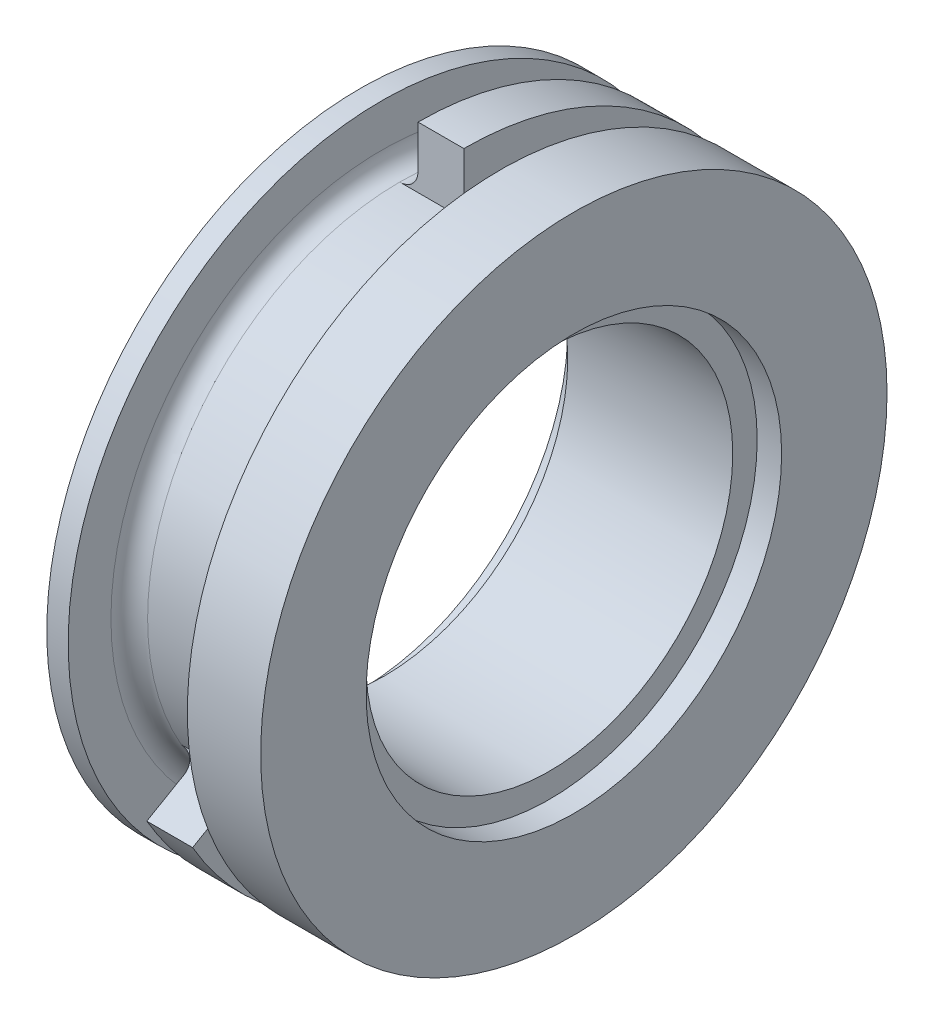
ISO-10303-21;
HEADER;
FILE_DESCRIPTION(('STEP AP214'),'2;1');
FILE_NAME('part.step','',(''),(''),'','','');
FILE_SCHEMA(('AUTOMOTIVE_DESIGN { 1 0 10303 214 1 1 1 1 }'));
ENDSEC;
DATA;
#1=APPLICATION_CONTEXT('core data for automotive mechanical design processes');
#2=APPLICATION_PROTOCOL_DEFINITION('international standard','automotive_design',2000,#1);
#3=PRODUCT_CONTEXT('',#1,'mechanical');
#4=PRODUCT('Part','Part','',(#3));
#5=PRODUCT_RELATED_PRODUCT_CATEGORY('part','',(#4));
#6=PRODUCT_DEFINITION_FORMATION('','',#4);
#7=PRODUCT_DEFINITION_CONTEXT('part definition',#1,'design');
#8=PRODUCT_DEFINITION('design','',#6,#7);
#9=PRODUCT_DEFINITION_SHAPE('','',#8);
#10=(LENGTH_UNIT() NAMED_UNIT(*) SI_UNIT(.MILLI.,.METRE.));
#11=(NAMED_UNIT(*) PLANE_ANGLE_UNIT() SI_UNIT($,.RADIAN.));
#12=(NAMED_UNIT(*) SI_UNIT($,.STERADIAN.) SOLID_ANGLE_UNIT());
#13=UNCERTAINTY_MEASURE_WITH_UNIT(LENGTH_MEASURE(1.E-05),#10,'distance_accuracy_value','');
#14=(GEOMETRIC_REPRESENTATION_CONTEXT(3) GLOBAL_UNCERTAINTY_ASSIGNED_CONTEXT((#13)) GLOBAL_UNIT_ASSIGNED_CONTEXT((#10,
#11,#12)) REPRESENTATION_CONTEXT('',''));
#15=CARTESIAN_POINT('',(0.,0.,0.));
#16=DIRECTION('',(0.,0.,1.));
#17=DIRECTION('',(1.,0.,0.));
#18=AXIS2_PLACEMENT_3D('',#15,#16,#17);
#19=CARTESIAN_POINT('',(7.,0.,0.));
#20=DIRECTION('',(1.,0.,0.));
#21=DIRECTION('',(0.,0.,-1.));
#22=AXIS2_PLACEMENT_3D('',#19,#20,#21);
#23=CYLINDRICAL_SURFACE('',#22,6.);
#24=CARTESIAN_POINT('',(6.2,0.,0.));
#25=DIRECTION('',(1.,0.,0.));
#26=DIRECTION('',(0.,0.,-1.));
#27=AXIS2_PLACEMENT_3D('',#24,#25,#26);
#28=CIRCLE('',#27,6.);
#29=CARTESIAN_POINT('',(6.2,0.,-6.));
#30=VERTEX_POINT('',#29);
#31=EDGE_CURVE('E180',#30,#30,#28,.T.);
#32=ORIENTED_EDGE('',*,*,#31,.T.);
#33=EDGE_LOOP('',(#32));
#34=FACE_BOUND('',#33,.T.);
#35=CARTESIAN_POINT('',(0.8,0.,0.));
#36=DIRECTION('',(-1.,0.,0.));
#37=DIRECTION('',(0.,0.,1.));
#38=AXIS2_PLACEMENT_3D('',#35,#36,#37);
#39=CIRCLE('',#38,6.);
#40=CARTESIAN_POINT('',(0.8,0.,6.));
#41=VERTEX_POINT('',#40);
#42=EDGE_CURVE('E51',#41,#41,#39,.T.);
#43=ORIENTED_EDGE('',*,*,#42,.T.);
#44=EDGE_LOOP('',(#43));
#45=FACE_BOUND('',#44,.T.);
#46=ADVANCED_FACE('F47',(#34,#45),#23,.F.);
#47=CARTESIAN_POINT('',(7.,0.,0.));
#48=DIRECTION('',(-1.,0.,0.));
#49=DIRECTION('',(0.,0.,1.));
#50=AXIS2_PLACEMENT_3D('',#47,#48,#49);
#51=PLANE('',#50);
#52=CARTESIAN_POINT('',(7.,0.,0.));
#53=DIRECTION('',(1.,0.,0.));
#54=DIRECTION('',(0.,0.,-1.));
#55=AXIS2_PLACEMENT_3D('',#52,#53,#54);
#56=CIRCLE('',#55,6.8);
#57=CARTESIAN_POINT('',(7.,0.,-6.8));
#58=VERTEX_POINT('',#57);
#59=EDGE_CURVE('E188',#58,#58,#56,.T.);
#60=ORIENTED_EDGE('',*,*,#59,.F.);
#61=EDGE_LOOP('',(#60));
#62=FACE_BOUND('',#61,.T.);
#63=CARTESIAN_POINT('',(7.,0.,0.));
#64=DIRECTION('',(1.,0.,0.));
#65=DIRECTION('',(0.,0.,-1.));
#66=AXIS2_PLACEMENT_3D('',#63,#64,#65);
#67=CIRCLE('',#66,10.25);
#68=CARTESIAN_POINT('',(7.,0.,-10.25));
#69=VERTEX_POINT('',#68);
#70=EDGE_CURVE('E136',#69,#69,#67,.T.);
#71=ORIENTED_EDGE('',*,*,#70,.T.);
#72=EDGE_LOOP('',(#71));
#73=FACE_BOUND('',#72,.T.);
#74=ADVANCED_FACE('F243',(#62,#73),#51,.F.);
#75=CARTESIAN_POINT('',(7.,0.,0.));
#76=DIRECTION('',(1.,0.,0.));
#77=DIRECTION('',(0.,0.,-1.));
#78=AXIS2_PLACEMENT_3D('',#75,#76,#77);
#79=CYLINDRICAL_SURFACE('',#78,10.25);
#80=ORIENTED_EDGE('',*,*,#70,.F.);
#81=EDGE_LOOP('',(#80));
#82=FACE_BOUND('',#81,.T.);
#83=CARTESIAN_POINT('',(4.6,0.,0.));
#84=DIRECTION('',(1.,0.,0.));
#85=DIRECTION('',(0.,0.,-1.));
#86=AXIS2_PLACEMENT_3D('',#83,#84,#85);
#87=CIRCLE('',#86,10.25);
#88=CARTESIAN_POINT('',(4.6,0.,-10.25));
#89=VERTEX_POINT('',#88);
#90=EDGE_CURVE('E131',#89,#89,#87,.T.);
#91=ORIENTED_EDGE('',*,*,#90,.T.);
#92=EDGE_LOOP('',(#91));
#93=FACE_BOUND('',#92,.T.);
#94=ADVANCED_FACE('F248',(#82,#93),#79,.T.);
#95=CARTESIAN_POINT('',(4.6,0.,0.));
#96=DIRECTION('',(1.,0.,0.));
#97=DIRECTION('',(0.,0.,-1.));
#98=AXIS2_PLACEMENT_3D('',#95,#96,#97);
#99=PLANE('',#98);
#100=CARTESIAN_POINT('',(4.6,0.,0.));
#101=DIRECTION('',(1.,0.,0.));
#102=DIRECTION('',(0.,0.,-1.));
#103=AXIS2_PLACEMENT_3D('',#100,#101,#102);
#104=CIRCLE('',#103,8.85);
#105=CARTESIAN_POINT('',(4.6,0.,-8.85));
#106=VERTEX_POINT('',#105);
#107=EDGE_CURVE('E145',#106,#106,#104,.T.);
#108=ORIENTED_EDGE('',*,*,#107,.T.);
#109=EDGE_LOOP('',(#108));
#110=FACE_BOUND('',#109,.T.);
#111=ORIENTED_EDGE('',*,*,#90,.F.);
#112=EDGE_LOOP('',(#111));
#113=FACE_BOUND('',#112,.T.);
#114=ADVANCED_FACE('F405',(#110,#113),#99,.F.);
#115=CARTESIAN_POINT('',(3.4,0.,0.));
#116=DIRECTION('',(-1.,0.,0.));
#117=DIRECTION('',(0.,0.,1.));
#118=AXIS2_PLACEMENT_3D('',#115,#116,#117);
#119=PLANE('',#118);
#120=DIRECTION('',(0.,1.,0.));
#121=VECTOR('',#120,1.);
#122=CARTESIAN_POINT('',(3.4,10.25,0.));
#123=LINE('',#122,#121);
#124=CARTESIAN_POINT('',(3.4,8.85,0.));
#125=VERTEX_POINT('',#124);
#126=CARTESIAN_POINT('',(3.4,10.25,0.));
#127=VERTEX_POINT('',#126);
#128=EDGE_CURVE('E101',#125,#127,#123,.T.);
#129=ORIENTED_EDGE('',*,*,#128,.F.);
#130=CARTESIAN_POINT('',(3.4,0.,0.));
#131=DIRECTION('',(-1.,0.,0.));
#132=DIRECTION('',(0.,0.,1.));
#133=AXIS2_PLACEMENT_3D('',#130,#131,#132);
#134=CIRCLE('',#133,8.85);
#135=CARTESIAN_POINT('',(3.4,-4.42500000000004,7.66432482349226));
#136=VERTEX_POINT('',#135);
#137=EDGE_CURVE('E157',#125,#136,#134,.T.);
#138=ORIENTED_EDGE('',*,*,#137,.T.);
#139=DIRECTION('',(0.,-0.500000000000004,0.866025403784436));
#140=VECTOR('',#139,1.);
#141=CARTESIAN_POINT('',(3.4,-5.12500000000004,8.87676038879047));
#142=LINE('',#141,#140);
#143=CARTESIAN_POINT('',(3.4,-5.12500000000004,8.87676038879047));
#144=VERTEX_POINT('',#143);
#145=EDGE_CURVE('E128',#136,#144,#142,.T.);
#146=ORIENTED_EDGE('',*,*,#145,.T.);
#147=CARTESIAN_POINT('',(3.4,0.,0.));
#148=DIRECTION('',(1.,0.,0.));
#149=DIRECTION('',(0.,0.,-1.));
#150=AXIS2_PLACEMENT_3D('',#147,#148,#149);
#151=CIRCLE('',#150,10.25);
#152=EDGE_CURVE('E120',#144,#127,#151,.T.);
#153=ORIENTED_EDGE('',*,*,#152,.T.);
#154=EDGE_LOOP('',(#129,#138,#146,#153));
#155=FACE_BOUND('',#154,.T.);
#156=ADVANCED_FACE('F126',(#155),#119,.F.);
#157=CARTESIAN_POINT('',(7.,0.,0.));
#158=DIRECTION('',(1.,0.,0.));
#159=DIRECTION('',(0.,0.,-1.));
#160=AXIS2_PLACEMENT_3D('',#157,#158,#159);
#161=CYLINDRICAL_SURFACE('',#160,10.25);
#162=ORIENTED_EDGE('',*,*,#152,.F.);
#163=DIRECTION('',(-1.,0.,0.));
#164=VECTOR('',#163,1.);
#165=CARTESIAN_POINT('',(1.9,-5.12500000000004,8.87676038879047));
#166=LINE('',#165,#164);
#167=CARTESIAN_POINT('',(1.9,-5.12500000000004,8.87676038879047));
#168=VERTEX_POINT('',#167);
#169=EDGE_CURVE('E206',#144,#168,#166,.T.);
#170=ORIENTED_EDGE('',*,*,#169,.T.);
#171=CARTESIAN_POINT('',(1.9,0.,0.));
#172=DIRECTION('',(1.,0.,0.));
#173=DIRECTION('',(0.,0.,-1.));
#174=AXIS2_PLACEMENT_3D('',#171,#172,#173);
#175=CIRCLE('',#174,10.25);
#176=CARTESIAN_POINT('',(1.9,10.25,0.));
#177=VERTEX_POINT('',#176);
#178=EDGE_CURVE('E122',#168,#177,#175,.T.);
#179=ORIENTED_EDGE('',*,*,#178,.T.);
#180=DIRECTION('',(-1.,0.,0.));
#181=VECTOR('',#180,1.);
#182=CARTESIAN_POINT('',(1.9,10.25,0.));
#183=LINE('',#182,#181);
#184=EDGE_CURVE('E105',#127,#177,#183,.T.);
#185=ORIENTED_EDGE('',*,*,#184,.F.);
#186=EDGE_LOOP('',(#162,#170,#179,#185));
#187=FACE_BOUND('',#186,.T.);
#188=ADVANCED_FACE('F118',(#187),#161,.T.);
#189=CARTESIAN_POINT('',(1.9,0.,0.));
#190=DIRECTION('',(1.,0.,0.));
#191=DIRECTION('',(0.,0.,-1.));
#192=AXIS2_PLACEMENT_3D('',#189,#190,#191);
#193=PLANE('',#192);
#194=DIRECTION('',(0.,0.500000000000004,-0.866025403784436));
#195=VECTOR('',#194,1.);
#196=CARTESIAN_POINT('',(1.9,-5.12500000000004,8.87676038879047));
#197=LINE('',#196,#195);
#198=CARTESIAN_POINT('',(1.9,-4.42500000000003,7.66432482349226));
#199=VERTEX_POINT('',#198);
#200=EDGE_CURVE('E209',#168,#199,#197,.T.);
#201=ORIENTED_EDGE('',*,*,#200,.T.);
#202=CARTESIAN_POINT('',(1.9,0.,0.));
#203=DIRECTION('',(1.,0.,0.));
#204=DIRECTION('',(0.,0.,-1.));
#205=AXIS2_PLACEMENT_3D('',#202,#203,#204);
#206=CIRCLE('',#205,8.85);
#207=CARTESIAN_POINT('',(1.9,8.85,0.));
#208=VERTEX_POINT('',#207);
#209=EDGE_CURVE('E160',#199,#208,#206,.T.);
#210=ORIENTED_EDGE('',*,*,#209,.T.);
#211=DIRECTION('',(0.,-1.,0.));
#212=VECTOR('',#211,1.);
#213=CARTESIAN_POINT('',(1.9,10.25,0.));
#214=LINE('',#213,#212);
#215=EDGE_CURVE('E124',#177,#208,#214,.T.);
#216=ORIENTED_EDGE('',*,*,#215,.F.);
#217=ORIENTED_EDGE('',*,*,#178,.F.);
#218=EDGE_LOOP('',(#201,#210,#216,#217));
#219=FACE_BOUND('',#218,.T.);
#220=ADVANCED_FACE('F362',(#219),#193,.F.);
#221=CARTESIAN_POINT('',(7.,0.,0.));
#222=DIRECTION('',(1.,0.,0.));
#223=DIRECTION('',(0.,0.,-1.));
#224=AXIS2_PLACEMENT_3D('',#221,#222,#223);
#225=CYLINDRICAL_SURFACE('',#224,8.25);
#226=CARTESIAN_POINT('',(4.,0.,0.));
#227=DIRECTION('',(1.,0.,0.));
#228=DIRECTION('',(0.,0.,-1.));
#229=AXIS2_PLACEMENT_3D('',#226,#227,#228);
#230=CIRCLE('',#229,8.25);
#231=CARTESIAN_POINT('',(4.,-4.12500000000003,7.1447095812216));
#232=VERTEX_POINT('',#231);
#233=CARTESIAN_POINT('',(4.,8.25,0.));
#234=VERTEX_POINT('',#233);
#235=EDGE_CURVE('E153',#232,#234,#230,.F.);
#236=ORIENTED_EDGE('',*,*,#235,.T.);
#237=DIRECTION('',(1.,0.,0.));
#238=VECTOR('',#237,1.);
#239=CARTESIAN_POINT('',(1.9,8.25,0.));
#240=LINE('',#239,#238);
#241=CARTESIAN_POINT('',(1.3,8.25,0.));
#242=VERTEX_POINT('',#241);
#243=EDGE_CURVE('E201',#242,#234,#240,.T.);
#244=ORIENTED_EDGE('',*,*,#243,.F.);
#245=CARTESIAN_POINT('',(1.3,0.,0.));
#246=DIRECTION('',(-1.,0.,0.));
#247=DIRECTION('',(0.,0.,1.));
#248=AXIS2_PLACEMENT_3D('',#245,#246,#247);
#249=CIRCLE('',#248,8.25);
#250=CARTESIAN_POINT('',(1.3,-4.12500000000003,7.1447095812216));
#251=VERTEX_POINT('',#250);
#252=EDGE_CURVE('E149',#242,#251,#249,.F.);
#253=ORIENTED_EDGE('',*,*,#252,.T.);
#254=DIRECTION('',(1.,0.,0.));
#255=VECTOR('',#254,1.);
#256=CARTESIAN_POINT('',(1.9,-4.12500000000003,7.1447095812216));
#257=LINE('',#256,#255);
#258=EDGE_CURVE('E212',#251,#232,#257,.T.);
#259=ORIENTED_EDGE('',*,*,#258,.T.);
#260=EDGE_LOOP('',(#236,#244,#253,#259));
#261=FACE_BOUND('',#260,.T.);
#262=ADVANCED_FACE('F357',(#261),#225,.T.);
#263=CARTESIAN_POINT('',(0.7,0.,0.));
#264=DIRECTION('',(-1.,0.,0.));
#265=DIRECTION('',(0.,0.,1.));
#266=AXIS2_PLACEMENT_3D('',#263,#264,#265);
#267=PLANE('',#266);
#268=CARTESIAN_POINT('',(0.7,0.,0.));
#269=DIRECTION('',(-1.,0.,0.));
#270=DIRECTION('',(0.,0.,1.));
#271=AXIS2_PLACEMENT_3D('',#268,#269,#270);
#272=CIRCLE('',#271,8.85);
#273=CARTESIAN_POINT('',(0.7,0.,8.85));
#274=VERTEX_POINT('',#273);
#275=EDGE_CURVE('E163',#274,#274,#272,.T.);
#276=ORIENTED_EDGE('',*,*,#275,.T.);
#277=EDGE_LOOP('',(#276));
#278=FACE_BOUND('',#277,.T.);
#279=CARTESIAN_POINT('',(0.7,0.,0.));
#280=DIRECTION('',(1.,0.,0.));
#281=DIRECTION('',(0.,0.,-1.));
#282=AXIS2_PLACEMENT_3D('',#279,#280,#281);
#283=CIRCLE('',#282,10.25);
#284=CARTESIAN_POINT('',(0.7,0.,-10.25));
#285=VERTEX_POINT('',#284);
#286=EDGE_CURVE('E138',#285,#285,#283,.T.);
#287=ORIENTED_EDGE('',*,*,#286,.T.);
#288=EDGE_LOOP('',(#287));
#289=FACE_BOUND('',#288,.T.);
#290=ADVANCED_FACE('F222',(#278,#289),#267,.F.);
#291=CARTESIAN_POINT('',(7.,0.,0.));
#292=DIRECTION('',(1.,0.,0.));
#293=DIRECTION('',(0.,0.,-1.));
#294=AXIS2_PLACEMENT_3D('',#291,#292,#293);
#295=CYLINDRICAL_SURFACE('',#294,10.25);
#296=ORIENTED_EDGE('',*,*,#286,.F.);
#297=EDGE_LOOP('',(#296));
#298=FACE_BOUND('',#297,.T.);
#299=CARTESIAN_POINT('',(0.,0.,0.));
#300=DIRECTION('',(1.,0.,0.));
#301=DIRECTION('',(0.,0.,-1.));
#302=AXIS2_PLACEMENT_3D('',#299,#300,#301);
#303=CIRCLE('',#302,10.25);
#304=CARTESIAN_POINT('',(0.,0.,-10.25));
#305=VERTEX_POINT('',#304);
#306=EDGE_CURVE('E215',#305,#305,#303,.T.);
#307=ORIENTED_EDGE('',*,*,#306,.T.);
#308=EDGE_LOOP('',(#307));
#309=FACE_BOUND('',#308,.T.);
#310=ADVANCED_FACE('F224',(#298,#309),#295,.T.);
#311=CARTESIAN_POINT('',(0.,0.,0.));
#312=DIRECTION('',(1.,0.,0.));
#313=DIRECTION('',(0.,0.,-1.));
#314=AXIS2_PLACEMENT_3D('',#311,#312,#313);
#315=PLANE('',#314);
#316=CARTESIAN_POINT('',(0.,0.,0.));
#317=DIRECTION('',(-1.,0.,0.));
#318=DIRECTION('',(0.,0.,1.));
#319=AXIS2_PLACEMENT_3D('',#316,#317,#318);
#320=CIRCLE('',#319,6.8);
#321=CARTESIAN_POINT('',(0.,0.,6.8));
#322=VERTEX_POINT('',#321);
#323=EDGE_CURVE('E196',#322,#322,#320,.T.);
#324=ORIENTED_EDGE('',*,*,#323,.F.);
#325=EDGE_LOOP('',(#324));
#326=FACE_BOUND('',#325,.T.);
#327=ORIENTED_EDGE('',*,*,#306,.F.);
#328=EDGE_LOOP('',(#327));
#329=FACE_BOUND('',#328,.T.);
#330=ADVANCED_FACE('F227',(#326,#329),#315,.F.);
#331=CARTESIAN_POINT('',(0.,0.,0.));
#332=DIRECTION('',(0.,-0.866025403784436,-0.500000000000004));
#333=DIRECTION('',(1.,0.,0.));
#334=AXIS2_PLACEMENT_3D('',#331,#332,#333);
#335=PLANE('',#334);
#336=ORIENTED_EDGE('',*,*,#145,.F.);
#337=CARTESIAN_POINT('',(4.,-4.42500000000004,7.66432482349226));
#338=DIRECTION('',(0.,-0.866025403784436,-0.500000000000004));
#339=DIRECTION('',(0.,0.500000000000004,-0.866025403784436));
#340=AXIS2_PLACEMENT_3D('',#337,#338,#339);
#341=CIRCLE('',#340,0.6);
#342=EDGE_CURVE('E169',#136,#232,#341,.T.);
#343=ORIENTED_EDGE('',*,*,#342,.T.);
#344=ORIENTED_EDGE('',*,*,#258,.F.);
#345=CARTESIAN_POINT('',(1.3,-4.42500000000004,7.66432482349226));
#346=DIRECTION('',(0.,-0.866025403784436,-0.500000000000004));
#347=DIRECTION('',(0.,0.500000000000004,-0.866025403784436));
#348=AXIS2_PLACEMENT_3D('',#345,#346,#347);
#349=CIRCLE('',#348,0.6);
#350=EDGE_CURVE('E11',#251,#199,#349,.T.);
#351=ORIENTED_EDGE('',*,*,#350,.T.);
#352=ORIENTED_EDGE('',*,*,#200,.F.);
#353=ORIENTED_EDGE('',*,*,#169,.F.);
#354=EDGE_LOOP('',(#336,#343,#344,#351,#352,#353));
#355=FACE_BOUND('',#354,.T.);
#356=ADVANCED_FACE('F232',(#355),#335,.F.);
#357=CARTESIAN_POINT('',(0.,0.,0.));
#358=DIRECTION('',(0.,0.,1.));
#359=DIRECTION('',(1.,0.,0.));
#360=AXIS2_PLACEMENT_3D('',#357,#358,#359);
#361=PLANE('',#360);
#362=ORIENTED_EDGE('',*,*,#243,.T.);
#363=CARTESIAN_POINT('',(4.,8.85,0.));
#364=DIRECTION('',(0.,0.,1.));
#365=DIRECTION('',(1.,0.,0.));
#366=AXIS2_PLACEMENT_3D('',#363,#364,#365);
#367=CIRCLE('',#366,0.6);
#368=EDGE_CURVE('E108',#234,#125,#367,.F.);
#369=ORIENTED_EDGE('',*,*,#368,.T.);
#370=ORIENTED_EDGE('',*,*,#128,.T.);
#371=ORIENTED_EDGE('',*,*,#184,.T.);
#372=ORIENTED_EDGE('',*,*,#215,.T.);
#373=CARTESIAN_POINT('',(1.3,8.85,0.));
#374=DIRECTION('',(0.,0.,1.));
#375=DIRECTION('',(1.,0.,0.));
#376=AXIS2_PLACEMENT_3D('',#373,#374,#375);
#377=CIRCLE('',#376,0.6);
#378=EDGE_CURVE('E57',#208,#242,#377,.F.);
#379=ORIENTED_EDGE('',*,*,#378,.T.);
#380=EDGE_LOOP('',(#362,#369,#370,#371,#372,#379));
#381=FACE_BOUND('',#380,.T.);
#382=ADVANCED_FACE('F103',(#381),#361,.T.);
#383=CARTESIAN_POINT('',(4.,0.,0.));
#384=DIRECTION('',(-1.,0.,0.));
#385=DIRECTION('',(0.,0.,1.));
#386=AXIS2_PLACEMENT_3D('',#383,#384,#385);
#387=TOROIDAL_SURFACE('',#386,8.85,0.6);
#388=CARTESIAN_POINT('',(4.,0.,0.));
#389=DIRECTION('',(-1.,0.,0.));
#390=DIRECTION('',(0.,0.,1.));
#391=AXIS2_PLACEMENT_3D('',#388,#389,#390);
#392=CIRCLE('',#391,8.25);
#393=EDGE_CURVE('E113',#232,#234,#392,.F.);
#394=ORIENTED_EDGE('',*,*,#393,.F.);
#395=ORIENTED_EDGE('',*,*,#342,.F.);
#396=ORIENTED_EDGE('',*,*,#137,.F.);
#397=ORIENTED_EDGE('',*,*,#368,.F.);
#398=EDGE_LOOP('',(#394,#395,#396,#397));
#399=FACE_BOUND('',#398,.T.);
#400=ADVANCED_FACE('F255',(#399),#387,.F.);
#401=CARTESIAN_POINT('',(4.,0.,0.));
#402=DIRECTION('',(1.,0.,0.));
#403=DIRECTION('',(0.,0.,-1.));
#404=AXIS2_PLACEMENT_3D('',#401,#402,#403);
#405=TOROIDAL_SURFACE('',#404,8.85,0.6);
#406=ORIENTED_EDGE('',*,*,#235,.F.);
#407=ORIENTED_EDGE('',*,*,#393,.T.);
#408=EDGE_LOOP('',(#406,#407));
#409=FACE_BOUND('',#408,.T.);
#410=ORIENTED_EDGE('',*,*,#107,.F.);
#411=EDGE_LOOP('',(#410));
#412=FACE_BOUND('',#411,.T.);
#413=ADVANCED_FACE('F321',(#409,#412),#405,.F.);
#414=CARTESIAN_POINT('',(1.3,0.,0.));
#415=DIRECTION('',(-1.,0.,0.));
#416=DIRECTION('',(0.,0.,1.));
#417=AXIS2_PLACEMENT_3D('',#414,#415,#416);
#418=TOROIDAL_SURFACE('',#417,8.85,0.6);
#419=ORIENTED_EDGE('',*,*,#275,.F.);
#420=EDGE_LOOP('',(#419));
#421=FACE_BOUND('',#420,.T.);
#422=CARTESIAN_POINT('',(1.3,0.,0.));
#423=DIRECTION('',(-1.,0.,0.));
#424=DIRECTION('',(0.,0.,1.));
#425=AXIS2_PLACEMENT_3D('',#422,#423,#424);
#426=CIRCLE('',#425,8.25);
#427=EDGE_CURVE('E178',#251,#242,#426,.F.);
#428=ORIENTED_EDGE('',*,*,#427,.F.);
#429=ORIENTED_EDGE('',*,*,#252,.F.);
#430=EDGE_LOOP('',(#428,#429));
#431=FACE_BOUND('',#430,.T.);
#432=ADVANCED_FACE('F49',(#421,#431),#418,.F.);
#433=CARTESIAN_POINT('',(1.3,0.,0.));
#434=DIRECTION('',(1.,0.,0.));
#435=DIRECTION('',(0.,0.,-1.));
#436=AXIS2_PLACEMENT_3D('',#433,#434,#435);
#437=TOROIDAL_SURFACE('',#436,8.85,0.6);
#438=ORIENTED_EDGE('',*,*,#350,.F.);
#439=ORIENTED_EDGE('',*,*,#427,.T.);
#440=ORIENTED_EDGE('',*,*,#378,.F.);
#441=ORIENTED_EDGE('',*,*,#209,.F.);
#442=EDGE_LOOP('',(#438,#439,#440,#441));
#443=FACE_BOUND('',#442,.T.);
#444=ADVANCED_FACE('F260',(#443),#437,.F.);
#445=CARTESIAN_POINT('',(6.2,0.,0.));
#446=DIRECTION('',(1.,0.,0.));
#447=DIRECTION('',(0.,0.,-1.));
#448=AXIS2_PLACEMENT_3D('',#445,#446,#447);
#449=CYLINDRICAL_SURFACE('',#448,6.8);
#450=CARTESIAN_POINT('',(6.2,0.,0.));
#451=DIRECTION('',(1.,0.,0.));
#452=DIRECTION('',(0.,0.,-1.));
#453=AXIS2_PLACEMENT_3D('',#450,#451,#452);
#454=CIRCLE('',#453,6.8);
#455=CARTESIAN_POINT('',(6.2,0.,-6.8));
#456=VERTEX_POINT('',#455);
#457=EDGE_CURVE('E183',#456,#456,#454,.T.);
#458=ORIENTED_EDGE('',*,*,#457,.F.);
#459=EDGE_LOOP('',(#458));
#460=FACE_BOUND('',#459,.T.);
#461=ORIENTED_EDGE('',*,*,#59,.T.);
#462=EDGE_LOOP('',(#461));
#463=FACE_BOUND('',#462,.T.);
#464=ADVANCED_FACE('F256',(#460,#463),#449,.F.);
#465=CARTESIAN_POINT('',(6.2,0.,0.));
#466=DIRECTION('',(1.,0.,0.));
#467=DIRECTION('',(0.,0.,-1.));
#468=AXIS2_PLACEMENT_3D('',#465,#466,#467);
#469=PLANE('',#468);
#470=ORIENTED_EDGE('',*,*,#31,.F.);
#471=EDGE_LOOP('',(#470));
#472=FACE_BOUND('',#471,.T.);
#473=ORIENTED_EDGE('',*,*,#457,.T.);
#474=EDGE_LOOP('',(#473));
#475=FACE_BOUND('',#474,.T.);
#476=ADVANCED_FACE('F259',(#472,#475),#469,.T.);
#477=CARTESIAN_POINT('',(0.8,0.,0.));
#478=DIRECTION('',(-1.,0.,0.));
#479=DIRECTION('',(0.,0.,1.));
#480=AXIS2_PLACEMENT_3D('',#477,#478,#479);
#481=CYLINDRICAL_SURFACE('',#480,6.8);
#482=CARTESIAN_POINT('',(0.8,0.,0.));
#483=DIRECTION('',(-1.,0.,0.));
#484=DIRECTION('',(0.,0.,1.));
#485=AXIS2_PLACEMENT_3D('',#482,#483,#484);
#486=CIRCLE('',#485,6.8);
#487=CARTESIAN_POINT('',(0.8,0.,6.8));
#488=VERTEX_POINT('',#487);
#489=EDGE_CURVE('E277',#488,#488,#486,.T.);
#490=ORIENTED_EDGE('',*,*,#489,.F.);
#491=EDGE_LOOP('',(#490));
#492=FACE_BOUND('',#491,.T.);
#493=ORIENTED_EDGE('',*,*,#323,.T.);
#494=EDGE_LOOP('',(#493));
#495=FACE_BOUND('',#494,.T.);
#496=ADVANCED_FACE('F263',(#492,#495),#481,.F.);
#497=CARTESIAN_POINT('',(0.8,0.,0.));
#498=DIRECTION('',(-1.,0.,0.));
#499=DIRECTION('',(0.,0.,1.));
#500=AXIS2_PLACEMENT_3D('',#497,#498,#499);
#501=PLANE('',#500);
#502=ORIENTED_EDGE('',*,*,#42,.F.);
#503=EDGE_LOOP('',(#502));
#504=FACE_BOUND('',#503,.T.);
#505=ORIENTED_EDGE('',*,*,#489,.T.);
#506=EDGE_LOOP('',(#505));
#507=FACE_BOUND('',#506,.T.);
#508=ADVANCED_FACE('F266',(#504,#507),#501,.T.);
#509=CLOSED_SHELL('',(#46,#74,#94,#114,#156,#188,#220,#262,#290,#310,#330,#356,#382,#400,#413,
#432,#444,#464,#476,#496,#508));
#510=MANIFOLD_SOLID_BREP('B2',#509);
#511=ADVANCED_BREP_SHAPE_REPRESENTATION('',(#18,#510),#14);
#512=SHAPE_DEFINITION_REPRESENTATION(#9,#511);
ENDSEC;
END-ISO-10303-21;
